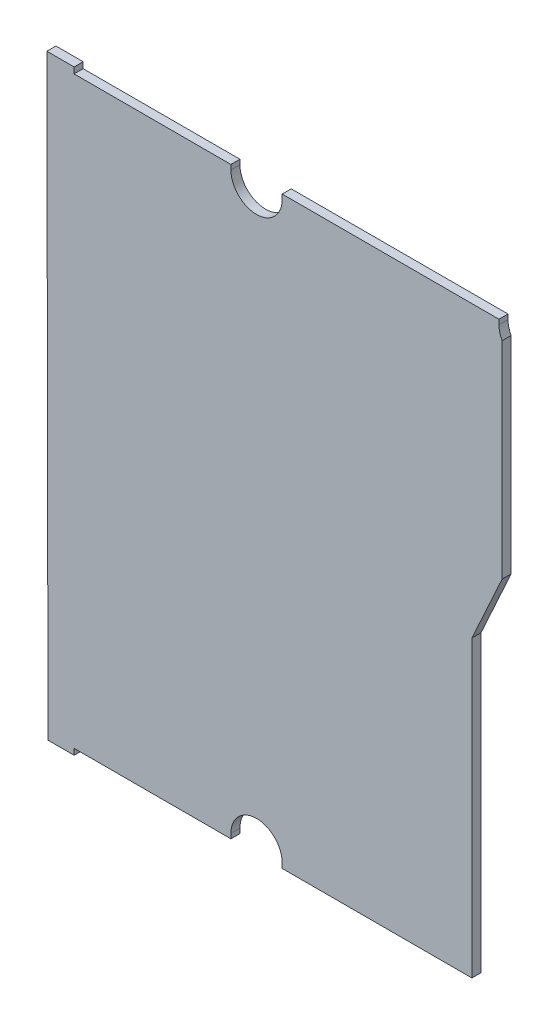
ISO-10303-21;
HEADER;
FILE_DESCRIPTION(('STEP AP214'),'2;1');
FILE_NAME('part.step','',(''),(''),'','','');
FILE_SCHEMA(('AUTOMOTIVE_DESIGN { 1 0 10303 214 1 1 1 1 }'));
ENDSEC;
DATA;
#1=APPLICATION_CONTEXT('core data for automotive mechanical design processes');
#2=APPLICATION_PROTOCOL_DEFINITION('international standard','automotive_design',2000,#1);
#3=PRODUCT_CONTEXT('',#1,'mechanical');
#4=PRODUCT('Part','Part','',(#3));
#5=PRODUCT_RELATED_PRODUCT_CATEGORY('part','',(#4));
#6=PRODUCT_DEFINITION_FORMATION('','',#4);
#7=PRODUCT_DEFINITION_CONTEXT('part definition',#1,'design');
#8=PRODUCT_DEFINITION('design','',#6,#7);
#9=PRODUCT_DEFINITION_SHAPE('','',#8);
#10=(LENGTH_UNIT() NAMED_UNIT(*) SI_UNIT(.MILLI.,.METRE.));
#11=(NAMED_UNIT(*) PLANE_ANGLE_UNIT() SI_UNIT($,.RADIAN.));
#12=(NAMED_UNIT(*) SI_UNIT($,.STERADIAN.) SOLID_ANGLE_UNIT());
#13=UNCERTAINTY_MEASURE_WITH_UNIT(LENGTH_MEASURE(1.E-05),#10,'distance_accuracy_value','');
#14=(GEOMETRIC_REPRESENTATION_CONTEXT(3) GLOBAL_UNCERTAINTY_ASSIGNED_CONTEXT((#13)) GLOBAL_UNIT_ASSIGNED_CONTEXT((#10,
#11,#12)) REPRESENTATION_CONTEXT('',''));
#15=CARTESIAN_POINT('',(0.,0.,0.));
#16=DIRECTION('',(0.,0.,1.));
#17=DIRECTION('',(1.,0.,0.));
#18=AXIS2_PLACEMENT_3D('',#15,#16,#17);
#19=CARTESIAN_POINT('',(-66.7950000000001,-49.425,1.5));
#20=DIRECTION('',(0.,1.,0.));
#21=DIRECTION('',(0.,0.,1.));
#22=AXIS2_PLACEMENT_3D('',#19,#20,#21);
#23=PLANE('',#22);
#24=DIRECTION('',(1.,0.,0.));
#25=VECTOR('',#24,1.);
#26=CARTESIAN_POINT('',(-66.7950000000001,-49.425,0.));
#27=LINE('',#26,#25);
#28=CARTESIAN_POINT('',(-66.7950000000001,-49.425,0.));
#29=VERTEX_POINT('',#28);
#30=CARTESIAN_POINT('',(-62.4676,-49.425,0.));
#31=VERTEX_POINT('',#30);
#32=EDGE_CURVE('E205',#29,#31,#27,.T.);
#33=ORIENTED_EDGE('',*,*,#32,.T.);
#34=DIRECTION('',(0.,0.,-1.));
#35=VECTOR('',#34,1.);
#36=CARTESIAN_POINT('',(-62.4676,-49.425,1.5));
#37=LINE('',#36,#35);
#38=CARTESIAN_POINT('',(-62.4676,-49.425,1.5));
#39=VERTEX_POINT('',#38);
#40=EDGE_CURVE('E11',#39,#31,#37,.T.);
#41=ORIENTED_EDGE('',*,*,#40,.F.);
#42=DIRECTION('',(1.,0.,0.));
#43=VECTOR('',#42,1.);
#44=CARTESIAN_POINT('',(-66.7950000000001,-49.425,1.5));
#45=LINE('',#44,#43);
#46=CARTESIAN_POINT('',(-66.7950000000001,-49.425,1.5));
#47=VERTEX_POINT('',#46);
#48=EDGE_CURVE('E243',#47,#39,#45,.T.);
#49=ORIENTED_EDGE('',*,*,#48,.F.);
#50=DIRECTION('',(0.,0.,-1.));
#51=VECTOR('',#50,1.);
#52=CARTESIAN_POINT('',(-66.7950000000001,-49.425,1.5));
#53=LINE('',#52,#51);
#54=EDGE_CURVE('E201',#47,#29,#53,.T.);
#55=ORIENTED_EDGE('',*,*,#54,.T.);
#56=EDGE_LOOP('',(#33,#41,#49,#55));
#57=FACE_BOUND('',#56,.T.);
#58=ADVANCED_FACE('F37',(#57),#23,.F.);
#59=CARTESIAN_POINT('',(-62.4676,-49.425,1.5));
#60=DIRECTION('',(-1.,0.,0.));
#61=DIRECTION('',(0.,0.,1.));
#62=AXIS2_PLACEMENT_3D('',#59,#60,#61);
#63=PLANE('',#62);
#64=DIRECTION('',(0.,1.,0.));
#65=VECTOR('',#64,1.);
#66=CARTESIAN_POINT('',(-62.4676,-49.425,0.));
#67=LINE('',#66,#65);
#68=CARTESIAN_POINT('',(-62.4676,-48.425,0.));
#69=VERTEX_POINT('',#68);
#70=EDGE_CURVE('E208',#31,#69,#67,.T.);
#71=ORIENTED_EDGE('',*,*,#70,.T.);
#72=DIRECTION('',(0.,0.,-1.));
#73=VECTOR('',#72,1.);
#74=CARTESIAN_POINT('',(-62.4676,-48.425,1.5));
#75=LINE('',#74,#73);
#76=CARTESIAN_POINT('',(-62.4676,-48.425,1.5));
#77=VERTEX_POINT('',#76);
#78=EDGE_CURVE('E45',#77,#69,#75,.T.);
#79=ORIENTED_EDGE('',*,*,#78,.F.);
#80=DIRECTION('',(0.,1.,0.));
#81=VECTOR('',#80,1.);
#82=CARTESIAN_POINT('',(-62.4676,-49.425,1.5));
#83=LINE('',#82,#81);
#84=EDGE_CURVE('E132',#39,#77,#83,.T.);
#85=ORIENTED_EDGE('',*,*,#84,.F.);
#86=ORIENTED_EDGE('',*,*,#40,.T.);
#87=EDGE_LOOP('',(#71,#79,#85,#86));
#88=FACE_BOUND('',#87,.T.);
#89=ADVANCED_FACE('F361',(#88),#63,.F.);
#90=CARTESIAN_POINT('',(-62.4676,-48.425,1.5));
#91=DIRECTION('',(0.,1.,0.));
#92=DIRECTION('',(0.,0.,1.));
#93=AXIS2_PLACEMENT_3D('',#90,#91,#92);
#94=PLANE('',#93);
#95=DIRECTION('',(1.,0.,0.));
#96=VECTOR('',#95,1.);
#97=CARTESIAN_POINT('',(-62.4676,-48.425,0.));
#98=LINE('',#97,#96);
#99=CARTESIAN_POINT('',(-36.4676,-48.425,0.));
#100=VERTEX_POINT('',#99);
#101=EDGE_CURVE('E210',#69,#100,#98,.T.);
#102=ORIENTED_EDGE('',*,*,#101,.T.);
#103=DIRECTION('',(0.,0.,-1.));
#104=VECTOR('',#103,1.);
#105=CARTESIAN_POINT('',(-36.4676,-48.425,1.5));
#106=LINE('',#105,#104);
#107=CARTESIAN_POINT('',(-36.4676,-48.425,1.5));
#108=VERTEX_POINT('',#107);
#109=EDGE_CURVE('E286',#108,#100,#106,.T.);
#110=ORIENTED_EDGE('',*,*,#109,.F.);
#111=DIRECTION('',(1.,0.,0.));
#112=VECTOR('',#111,1.);
#113=CARTESIAN_POINT('',(-62.4676,-48.425,1.5));
#114=LINE('',#113,#112);
#115=EDGE_CURVE('E294',#77,#108,#114,.T.);
#116=ORIENTED_EDGE('',*,*,#115,.F.);
#117=ORIENTED_EDGE('',*,*,#78,.T.);
#118=EDGE_LOOP('',(#102,#110,#116,#117));
#119=FACE_BOUND('',#118,.T.);
#120=ADVANCED_FACE('F292',(#119),#94,.F.);
#121=CARTESIAN_POINT('',(-36.4676,-48.425,1.5));
#122=DIRECTION('',(-1.,0.,0.));
#123=DIRECTION('',(0.,0.,1.));
#124=AXIS2_PLACEMENT_3D('',#121,#122,#123);
#125=PLANE('',#124);
#126=DIRECTION('',(0.,1.,0.));
#127=VECTOR('',#126,1.);
#128=CARTESIAN_POINT('',(-36.4676,-48.425,0.));
#129=LINE('',#128,#127);
#130=CARTESIAN_POINT('',(-36.4676,-47.625,0.));
#131=VERTEX_POINT('',#130);
#132=EDGE_CURVE('E212',#100,#131,#129,.T.);
#133=ORIENTED_EDGE('',*,*,#132,.T.);
#134=DIRECTION('',(0.,0.,-1.));
#135=VECTOR('',#134,1.);
#136=CARTESIAN_POINT('',(-36.4676,-47.625,1.5));
#137=LINE('',#136,#135);
#138=CARTESIAN_POINT('',(-36.4676,-47.625,1.5));
#139=VERTEX_POINT('',#138);
#140=EDGE_CURVE('E283',#139,#131,#137,.T.);
#141=ORIENTED_EDGE('',*,*,#140,.F.);
#142=DIRECTION('',(0.,1.,0.));
#143=VECTOR('',#142,1.);
#144=CARTESIAN_POINT('',(-36.4676,-48.425,1.5));
#145=LINE('',#144,#143);
#146=EDGE_CURVE('E312',#108,#139,#145,.T.);
#147=ORIENTED_EDGE('',*,*,#146,.F.);
#148=ORIENTED_EDGE('',*,*,#109,.T.);
#149=EDGE_LOOP('',(#133,#141,#147,#148));
#150=FACE_BOUND('',#149,.T.);
#151=ADVANCED_FACE('F303',(#150),#125,.F.);
#152=CARTESIAN_POINT('',(-32.215,-47.625,1.5));
#153=DIRECTION('',(0.,0.,-1.));
#154=DIRECTION('',(-1.,0.,0.));
#155=AXIS2_PLACEMENT_3D('',#152,#153,#154);
#156=CYLINDRICAL_SURFACE('',#155,4.2526);
#157=CARTESIAN_POINT('',(-32.215,-47.625,0.));
#158=DIRECTION('',(0.,0.,-1.));
#159=DIRECTION('',(-1.,0.,0.));
#160=AXIS2_PLACEMENT_3D('',#157,#158,#159);
#161=CIRCLE('',#160,4.2526);
#162=CARTESIAN_POINT('',(-27.9624,-47.625,0.));
#163=VERTEX_POINT('',#162);
#164=EDGE_CURVE('E214',#131,#163,#161,.T.);
#165=ORIENTED_EDGE('',*,*,#164,.T.);
#166=DIRECTION('',(0.,0.,-1.));
#167=VECTOR('',#166,1.);
#168=CARTESIAN_POINT('',(-27.9624,-47.625,1.5));
#169=LINE('',#168,#167);
#170=CARTESIAN_POINT('',(-27.9624,-47.625,1.5));
#171=VERTEX_POINT('',#170);
#172=EDGE_CURVE('E280',#171,#163,#169,.T.);
#173=ORIENTED_EDGE('',*,*,#172,.F.);
#174=CARTESIAN_POINT('',(-32.215,-47.625,1.5));
#175=DIRECTION('',(0.,0.,-1.));
#176=DIRECTION('',(-1.,0.,0.));
#177=AXIS2_PLACEMENT_3D('',#174,#175,#176);
#178=CIRCLE('',#177,4.2526);
#179=EDGE_CURVE('E309',#139,#171,#178,.T.);
#180=ORIENTED_EDGE('',*,*,#179,.F.);
#181=ORIENTED_EDGE('',*,*,#140,.T.);
#182=EDGE_LOOP('',(#165,#173,#180,#181));
#183=FACE_BOUND('',#182,.T.);
#184=ADVANCED_FACE('F307',(#183),#156,.F.);
#185=CARTESIAN_POINT('',(-27.9624,-48.425,1.5));
#186=DIRECTION('',(1.,0.,0.));
#187=DIRECTION('',(0.,0.,-1.));
#188=AXIS2_PLACEMENT_3D('',#185,#186,#187);
#189=PLANE('',#188);
#190=DIRECTION('',(0.,-1.,0.));
#191=VECTOR('',#190,1.);
#192=CARTESIAN_POINT('',(-27.9624,-48.425,0.));
#193=LINE('',#192,#191);
#194=CARTESIAN_POINT('',(-27.9624,-48.425,0.));
#195=VERTEX_POINT('',#194);
#196=EDGE_CURVE('E216',#163,#195,#193,.T.);
#197=ORIENTED_EDGE('',*,*,#196,.T.);
#198=DIRECTION('',(0.,0.,-1.));
#199=VECTOR('',#198,1.);
#200=CARTESIAN_POINT('',(-27.9624,-48.425,1.5));
#201=LINE('',#200,#199);
#202=CARTESIAN_POINT('',(-27.9624,-48.425,1.5));
#203=VERTEX_POINT('',#202);
#204=EDGE_CURVE('E277',#203,#195,#201,.T.);
#205=ORIENTED_EDGE('',*,*,#204,.F.);
#206=DIRECTION('',(0.,-1.,0.));
#207=VECTOR('',#206,1.);
#208=CARTESIAN_POINT('',(-27.9624,-48.425,1.5));
#209=LINE('',#208,#207);
#210=EDGE_CURVE('E311',#171,#203,#209,.T.);
#211=ORIENTED_EDGE('',*,*,#210,.F.);
#212=ORIENTED_EDGE('',*,*,#172,.T.);
#213=EDGE_LOOP('',(#197,#205,#211,#212));
#214=FACE_BOUND('',#213,.T.);
#215=ADVANCED_FACE('F374',(#214),#189,.F.);
#216=CARTESIAN_POINT('',(3.5,-48.425,1.5));
#217=DIRECTION('',(0.,1.,0.));
#218=DIRECTION('',(0.,0.,1.));
#219=AXIS2_PLACEMENT_3D('',#216,#217,#218);
#220=PLANE('',#219);
#221=DIRECTION('',(1.,0.,0.));
#222=VECTOR('',#221,1.);
#223=CARTESIAN_POINT('',(3.5,-48.425,0.));
#224=LINE('',#223,#222);
#225=CARTESIAN_POINT('',(3.5,-48.425,0.));
#226=VERTEX_POINT('',#225);
#227=EDGE_CURVE('E218',#195,#226,#224,.T.);
#228=ORIENTED_EDGE('',*,*,#227,.T.);
#229=DIRECTION('',(0.,0.,-1.));
#230=VECTOR('',#229,1.);
#231=CARTESIAN_POINT('',(3.5,-48.425,1.5));
#232=LINE('',#231,#230);
#233=CARTESIAN_POINT('',(3.5,-48.425,1.5));
#234=VERTEX_POINT('',#233);
#235=EDGE_CURVE('E274',#234,#226,#232,.T.);
#236=ORIENTED_EDGE('',*,*,#235,.F.);
#237=DIRECTION('',(1.,0.,0.));
#238=VECTOR('',#237,1.);
#239=CARTESIAN_POINT('',(3.5,-48.425,1.5));
#240=LINE('',#239,#238);
#241=EDGE_CURVE('E314',#203,#234,#240,.T.);
#242=ORIENTED_EDGE('',*,*,#241,.F.);
#243=ORIENTED_EDGE('',*,*,#204,.T.);
#244=EDGE_LOOP('',(#228,#236,#242,#243));
#245=FACE_BOUND('',#244,.T.);
#246=ADVANCED_FACE('F377',(#245),#220,.F.);
#247=CARTESIAN_POINT('',(3.5,0.401446139426954,1.5));
#248=DIRECTION('',(-1.,0.,0.));
#249=DIRECTION('',(0.,-1.,0.));
#250=AXIS2_PLACEMENT_3D('',#247,#248,#249);
#251=PLANE('',#250);
#252=DIRECTION('',(0.,1.,0.));
#253=VECTOR('',#252,1.);
#254=CARTESIAN_POINT('',(3.5,0.401446139426954,0.));
#255=LINE('',#254,#253);
#256=CARTESIAN_POINT('',(3.5,0.401446139426954,0.));
#257=VERTEX_POINT('',#256);
#258=EDGE_CURVE('E220',#226,#257,#255,.T.);
#259=ORIENTED_EDGE('',*,*,#258,.T.);
#260=DIRECTION('',(0.,0.,-1.));
#261=VECTOR('',#260,1.);
#262=CARTESIAN_POINT('',(3.5,0.401446139426954,1.5));
#263=LINE('',#262,#261);
#264=CARTESIAN_POINT('',(3.5,0.401446139426954,1.5));
#265=VERTEX_POINT('',#264);
#266=EDGE_CURVE('E271',#265,#257,#263,.T.);
#267=ORIENTED_EDGE('',*,*,#266,.F.);
#268=DIRECTION('',(0.,1.,0.));
#269=VECTOR('',#268,1.);
#270=CARTESIAN_POINT('',(3.5,0.401446139426954,1.5));
#271=LINE('',#270,#269);
#272=EDGE_CURVE('E320',#234,#265,#271,.T.);
#273=ORIENTED_EDGE('',*,*,#272,.F.);
#274=ORIENTED_EDGE('',*,*,#235,.T.);
#275=EDGE_LOOP('',(#259,#267,#273,#274));
#276=FACE_BOUND('',#275,.T.);
#277=ADVANCED_FACE('F381',(#276),#251,.F.);
#278=CARTESIAN_POINT('',(8.5,11.3447159940696,1.5));
#279=DIRECTION('',(-0.909557353352552,0.415578417344189,0.));
#280=DIRECTION('',(-0.415578417344189,-0.909557353352552,0.));
#281=AXIS2_PLACEMENT_3D('',#278,#279,#280);
#282=PLANE('',#281);
#283=DIRECTION('',(0.415578417344189,0.909557353352552,0.));
#284=VECTOR('',#283,1.);
#285=CARTESIAN_POINT('',(8.5,11.3447159940696,0.));
#286=LINE('',#285,#284);
#287=CARTESIAN_POINT('',(8.5,11.3447159940696,0.));
#288=VERTEX_POINT('',#287);
#289=EDGE_CURVE('E222',#257,#288,#286,.T.);
#290=ORIENTED_EDGE('',*,*,#289,.T.);
#291=DIRECTION('',(0.,0.,-1.));
#292=VECTOR('',#291,1.);
#293=CARTESIAN_POINT('',(8.5,11.3447159940696,1.5));
#294=LINE('',#293,#292);
#295=CARTESIAN_POINT('',(8.5,11.3447159940696,1.5));
#296=VERTEX_POINT('',#295);
#297=EDGE_CURVE('E268',#296,#288,#294,.T.);
#298=ORIENTED_EDGE('',*,*,#297,.F.);
#299=DIRECTION('',(0.415578417344189,0.909557353352552,0.));
#300=VECTOR('',#299,1.);
#301=CARTESIAN_POINT('',(8.5,11.3447159940696,1.5));
#302=LINE('',#301,#300);
#303=EDGE_CURVE('E322',#265,#296,#302,.T.);
#304=ORIENTED_EDGE('',*,*,#303,.F.);
#305=ORIENTED_EDGE('',*,*,#266,.T.);
#306=EDGE_LOOP('',(#290,#298,#304,#305));
#307=FACE_BOUND('',#306,.T.);
#308=ADVANCED_FACE('F385',(#307),#282,.F.);
#309=CARTESIAN_POINT('',(8.49999999999999,45.5916820809327,1.5));
#310=DIRECTION('',(-1.,0.,0.));
#311=DIRECTION('',(0.,-1.,0.));
#312=AXIS2_PLACEMENT_3D('',#309,#310,#311);
#313=PLANE('',#312);
#314=DIRECTION('',(0.,1.,0.));
#315=VECTOR('',#314,1.);
#316=CARTESIAN_POINT('',(8.49999999999999,45.5916820809327,0.));
#317=LINE('',#316,#315);
#318=CARTESIAN_POINT('',(8.5,45.5916820809327,0.));
#319=VERTEX_POINT('',#318);
#320=EDGE_CURVE('E224',#288,#319,#317,.T.);
#321=ORIENTED_EDGE('',*,*,#320,.T.);
#322=DIRECTION('',(0.,0.,-1.));
#323=VECTOR('',#322,1.);
#324=CARTESIAN_POINT('',(8.5,45.5916820809327,1.5));
#325=LINE('',#324,#323);
#326=CARTESIAN_POINT('',(8.5,45.5916820809327,1.5));
#327=VERTEX_POINT('',#326);
#328=EDGE_CURVE('E265',#327,#319,#325,.T.);
#329=ORIENTED_EDGE('',*,*,#328,.F.);
#330=DIRECTION('',(0.,1.,0.));
#331=VECTOR('',#330,1.);
#332=CARTESIAN_POINT('',(8.49999999999999,45.5916820809327,1.5));
#333=LINE('',#332,#331);
#334=EDGE_CURVE('E324',#296,#327,#333,.T.);
#335=ORIENTED_EDGE('',*,*,#334,.F.);
#336=ORIENTED_EDGE('',*,*,#297,.T.);
#337=EDGE_LOOP('',(#321,#329,#335,#336));
#338=FACE_BOUND('',#337,.T.);
#339=ADVANCED_FACE('F389',(#338),#313,.F.);
#340=CARTESIAN_POINT('',(12.235,47.625,1.5));
#341=DIRECTION('',(0.,0.,-1.));
#342=DIRECTION('',(-1.,0.,0.));
#343=AXIS2_PLACEMENT_3D('',#340,#341,#342);
#344=CYLINDRICAL_SURFACE('',#343,4.2526);
#345=CARTESIAN_POINT('',(12.235,47.625,0.));
#346=DIRECTION('',(0.,0.,-1.));
#347=DIRECTION('',(1.,0.,0.));
#348=AXIS2_PLACEMENT_3D('',#345,#346,#347);
#349=CIRCLE('',#348,4.2526);
#350=CARTESIAN_POINT('',(7.98239999999999,47.625,0.));
#351=VERTEX_POINT('',#350);
#352=EDGE_CURVE('E226',#319,#351,#349,.T.);
#353=ORIENTED_EDGE('',*,*,#352,.T.);
#354=DIRECTION('',(0.,0.,-1.));
#355=VECTOR('',#354,1.);
#356=CARTESIAN_POINT('',(7.98239999999999,47.625,1.5));
#357=LINE('',#356,#355);
#358=CARTESIAN_POINT('',(7.98239999999999,47.625,1.5));
#359=VERTEX_POINT('',#358);
#360=EDGE_CURVE('E262',#359,#351,#357,.T.);
#361=ORIENTED_EDGE('',*,*,#360,.F.);
#362=CARTESIAN_POINT('',(12.235,47.625,1.5));
#363=DIRECTION('',(0.,0.,-1.));
#364=DIRECTION('',(1.,0.,0.));
#365=AXIS2_PLACEMENT_3D('',#362,#363,#364);
#366=CIRCLE('',#365,4.2526);
#367=EDGE_CURVE('E326',#327,#359,#366,.T.);
#368=ORIENTED_EDGE('',*,*,#367,.F.);
#369=ORIENTED_EDGE('',*,*,#328,.T.);
#370=EDGE_LOOP('',(#353,#361,#368,#369));
#371=FACE_BOUND('',#370,.T.);
#372=ADVANCED_FACE('F393',(#371),#344,.F.);
#373=CARTESIAN_POINT('',(7.98239999999999,48.425,1.5));
#374=DIRECTION('',(-1.,0.,0.));
#375=DIRECTION('',(0.,-1.,0.));
#376=AXIS2_PLACEMENT_3D('',#373,#374,#375);
#377=PLANE('',#376);
#378=DIRECTION('',(0.,1.,0.));
#379=VECTOR('',#378,1.);
#380=CARTESIAN_POINT('',(7.98239999999999,48.425,0.));
#381=LINE('',#380,#379);
#382=CARTESIAN_POINT('',(7.98239999999999,48.425,0.));
#383=VERTEX_POINT('',#382);
#384=EDGE_CURVE('E228',#351,#383,#381,.T.);
#385=ORIENTED_EDGE('',*,*,#384,.T.);
#386=DIRECTION('',(0.,0.,-1.));
#387=VECTOR('',#386,1.);
#388=CARTESIAN_POINT('',(7.98239999999999,48.425,1.5));
#389=LINE('',#388,#387);
#390=CARTESIAN_POINT('',(7.98239999999999,48.425,1.5));
#391=VERTEX_POINT('',#390);
#392=EDGE_CURVE('E259',#391,#383,#389,.T.);
#393=ORIENTED_EDGE('',*,*,#392,.F.);
#394=DIRECTION('',(0.,1.,0.));
#395=VECTOR('',#394,1.);
#396=CARTESIAN_POINT('',(7.98239999999999,48.425,1.5));
#397=LINE('',#396,#395);
#398=EDGE_CURVE('E328',#359,#391,#397,.T.);
#399=ORIENTED_EDGE('',*,*,#398,.F.);
#400=ORIENTED_EDGE('',*,*,#360,.T.);
#401=EDGE_LOOP('',(#385,#393,#399,#400));
#402=FACE_BOUND('',#401,.T.);
#403=ADVANCED_FACE('F397',(#402),#377,.F.);
#404=CARTESIAN_POINT('',(7.98239999999999,48.425,1.5));
#405=DIRECTION('',(0.,-1.,0.));
#406=DIRECTION('',(0.,0.,-1.));
#407=AXIS2_PLACEMENT_3D('',#404,#405,#406);
#408=PLANE('',#407);
#409=DIRECTION('',(-1.,0.,0.));
#410=VECTOR('',#409,1.);
#411=CARTESIAN_POINT('',(7.98239999999999,48.425,0.));
#412=LINE('',#411,#410);
#413=CARTESIAN_POINT('',(-27.9624,48.425,0.));
#414=VERTEX_POINT('',#413);
#415=EDGE_CURVE('E230',#383,#414,#412,.T.);
#416=ORIENTED_EDGE('',*,*,#415,.T.);
#417=DIRECTION('',(0.,0.,-1.));
#418=VECTOR('',#417,1.);
#419=CARTESIAN_POINT('',(-27.9624,48.425,1.5));
#420=LINE('',#419,#418);
#421=CARTESIAN_POINT('',(-27.9624,48.425,1.5));
#422=VERTEX_POINT('',#421);
#423=EDGE_CURVE('E256',#422,#414,#420,.T.);
#424=ORIENTED_EDGE('',*,*,#423,.F.);
#425=DIRECTION('',(-1.,0.,0.));
#426=VECTOR('',#425,1.);
#427=CARTESIAN_POINT('',(7.98239999999999,48.425,1.5));
#428=LINE('',#427,#426);
#429=EDGE_CURVE('E330',#391,#422,#428,.T.);
#430=ORIENTED_EDGE('',*,*,#429,.F.);
#431=ORIENTED_EDGE('',*,*,#392,.T.);
#432=EDGE_LOOP('',(#416,#424,#430,#431));
#433=FACE_BOUND('',#432,.T.);
#434=ADVANCED_FACE('F401',(#433),#408,.F.);
#435=CARTESIAN_POINT('',(-27.9624,47.625,1.5));
#436=DIRECTION('',(1.,0.,0.));
#437=DIRECTION('',(0.,0.,-1.));
#438=AXIS2_PLACEMENT_3D('',#435,#436,#437);
#439=PLANE('',#438);
#440=DIRECTION('',(0.,-1.,0.));
#441=VECTOR('',#440,1.);
#442=CARTESIAN_POINT('',(-27.9624,47.625,0.));
#443=LINE('',#442,#441);
#444=CARTESIAN_POINT('',(-27.9624,47.625,0.));
#445=VERTEX_POINT('',#444);
#446=EDGE_CURVE('E232',#414,#445,#443,.T.);
#447=ORIENTED_EDGE('',*,*,#446,.T.);
#448=DIRECTION('',(0.,0.,-1.));
#449=VECTOR('',#448,1.);
#450=CARTESIAN_POINT('',(-27.9624,47.625,1.5));
#451=LINE('',#450,#449);
#452=CARTESIAN_POINT('',(-27.9624,47.625,1.5));
#453=VERTEX_POINT('',#452);
#454=EDGE_CURVE('E253',#453,#445,#451,.T.);
#455=ORIENTED_EDGE('',*,*,#454,.F.);
#456=DIRECTION('',(0.,-1.,0.));
#457=VECTOR('',#456,1.);
#458=CARTESIAN_POINT('',(-27.9624,47.625,1.5));
#459=LINE('',#458,#457);
#460=EDGE_CURVE('E332',#422,#453,#459,.T.);
#461=ORIENTED_EDGE('',*,*,#460,.F.);
#462=ORIENTED_EDGE('',*,*,#423,.T.);
#463=EDGE_LOOP('',(#447,#455,#461,#462));
#464=FACE_BOUND('',#463,.T.);
#465=ADVANCED_FACE('F405',(#464),#439,.F.);
#466=CARTESIAN_POINT('',(-32.215,47.625,1.5));
#467=DIRECTION('',(0.,0.,-1.));
#468=DIRECTION('',(-1.,0.,0.));
#469=AXIS2_PLACEMENT_3D('',#466,#467,#468);
#470=CYLINDRICAL_SURFACE('',#469,4.2526);
#471=CARTESIAN_POINT('',(-32.215,47.625,0.));
#472=DIRECTION('',(0.,0.,-1.));
#473=DIRECTION('',(1.,0.,0.));
#474=AXIS2_PLACEMENT_3D('',#471,#472,#473);
#475=CIRCLE('',#474,4.2526);
#476=CARTESIAN_POINT('',(-36.4676,47.625,0.));
#477=VERTEX_POINT('',#476);
#478=EDGE_CURVE('E234',#445,#477,#475,.T.);
#479=ORIENTED_EDGE('',*,*,#478,.T.);
#480=DIRECTION('',(0.,0.,-1.));
#481=VECTOR('',#480,1.);
#482=CARTESIAN_POINT('',(-36.4676,47.625,1.5));
#483=LINE('',#482,#481);
#484=CARTESIAN_POINT('',(-36.4676,47.625,1.5));
#485=VERTEX_POINT('',#484);
#486=EDGE_CURVE('E250',#485,#477,#483,.T.);
#487=ORIENTED_EDGE('',*,*,#486,.F.);
#488=CARTESIAN_POINT('',(-32.215,47.625,1.5));
#489=DIRECTION('',(0.,0.,-1.));
#490=DIRECTION('',(1.,0.,0.));
#491=AXIS2_PLACEMENT_3D('',#488,#489,#490);
#492=CIRCLE('',#491,4.2526);
#493=EDGE_CURVE('E334',#453,#485,#492,.T.);
#494=ORIENTED_EDGE('',*,*,#493,.F.);
#495=ORIENTED_EDGE('',*,*,#454,.T.);
#496=EDGE_LOOP('',(#479,#487,#494,#495));
#497=FACE_BOUND('',#496,.T.);
#498=ADVANCED_FACE('F409',(#497),#470,.F.);
#499=CARTESIAN_POINT('',(-36.4676,47.625,1.5));
#500=DIRECTION('',(-1.,0.,0.));
#501=DIRECTION('',(0.,0.,1.));
#502=AXIS2_PLACEMENT_3D('',#499,#500,#501);
#503=PLANE('',#502);
#504=DIRECTION('',(0.,1.,0.));
#505=VECTOR('',#504,1.);
#506=CARTESIAN_POINT('',(-36.4676,47.625,0.));
#507=LINE('',#506,#505);
#508=CARTESIAN_POINT('',(-36.4676,48.425,0.));
#509=VERTEX_POINT('',#508);
#510=EDGE_CURVE('E236',#477,#509,#507,.T.);
#511=ORIENTED_EDGE('',*,*,#510,.T.);
#512=DIRECTION('',(0.,0.,-1.));
#513=VECTOR('',#512,1.);
#514=CARTESIAN_POINT('',(-36.4676,48.425,1.5));
#515=LINE('',#514,#513);
#516=CARTESIAN_POINT('',(-36.4676,48.425,1.5));
#517=VERTEX_POINT('',#516);
#518=EDGE_CURVE('E247',#517,#509,#515,.T.);
#519=ORIENTED_EDGE('',*,*,#518,.F.);
#520=DIRECTION('',(0.,1.,0.));
#521=VECTOR('',#520,1.);
#522=CARTESIAN_POINT('',(-36.4676,47.625,1.5));
#523=LINE('',#522,#521);
#524=EDGE_CURVE('E336',#485,#517,#523,.T.);
#525=ORIENTED_EDGE('',*,*,#524,.F.);
#526=ORIENTED_EDGE('',*,*,#486,.T.);
#527=EDGE_LOOP('',(#511,#519,#525,#526));
#528=FACE_BOUND('',#527,.T.);
#529=ADVANCED_FACE('F342',(#528),#503,.F.);
#530=CARTESIAN_POINT('',(-62.4676,48.425,1.5));
#531=DIRECTION('',(0.,-1.,0.));
#532=DIRECTION('',(0.,0.,-1.));
#533=AXIS2_PLACEMENT_3D('',#530,#531,#532);
#534=PLANE('',#533);
#535=DIRECTION('',(-1.,0.,0.));
#536=VECTOR('',#535,1.);
#537=CARTESIAN_POINT('',(-62.4676,48.425,0.));
#538=LINE('',#537,#536);
#539=CARTESIAN_POINT('',(-62.4676,48.425,0.));
#540=VERTEX_POINT('',#539);
#541=EDGE_CURVE('E238',#509,#540,#538,.T.);
#542=ORIENTED_EDGE('',*,*,#541,.T.);
#543=DIRECTION('',(0.,0.,-1.));
#544=VECTOR('',#543,1.);
#545=CARTESIAN_POINT('',(-62.4676,48.425,1.5));
#546=LINE('',#545,#544);
#547=CARTESIAN_POINT('',(-62.4676,48.425,1.5));
#548=VERTEX_POINT('',#547);
#549=EDGE_CURVE('E196',#548,#540,#546,.T.);
#550=ORIENTED_EDGE('',*,*,#549,.F.);
#551=DIRECTION('',(-1.,0.,0.));
#552=VECTOR('',#551,1.);
#553=CARTESIAN_POINT('',(-62.4676,48.425,1.5));
#554=LINE('',#553,#552);
#555=EDGE_CURVE('E187',#517,#548,#554,.T.);
#556=ORIENTED_EDGE('',*,*,#555,.F.);
#557=ORIENTED_EDGE('',*,*,#518,.T.);
#558=EDGE_LOOP('',(#542,#550,#556,#557));
#559=FACE_BOUND('',#558,.T.);
#560=ADVANCED_FACE('F346',(#559),#534,.F.);
#561=CARTESIAN_POINT('',(-62.4676,49.425,1.5));
#562=DIRECTION('',(-1.,0.,0.));
#563=DIRECTION('',(0.,0.,1.));
#564=AXIS2_PLACEMENT_3D('',#561,#562,#563);
#565=PLANE('',#564);
#566=DIRECTION('',(0.,1.,0.));
#567=VECTOR('',#566,1.);
#568=CARTESIAN_POINT('',(-62.4676,49.425,0.));
#569=LINE('',#568,#567);
#570=CARTESIAN_POINT('',(-62.4676,49.425,0.));
#571=VERTEX_POINT('',#570);
#572=EDGE_CURVE('E195',#540,#571,#569,.T.);
#573=ORIENTED_EDGE('',*,*,#572,.T.);
#574=DIRECTION('',(0.,0.,-1.));
#575=VECTOR('',#574,1.);
#576=CARTESIAN_POINT('',(-62.4676,49.425,1.5));
#577=LINE('',#576,#575);
#578=CARTESIAN_POINT('',(-62.4676,49.425,1.5));
#579=VERTEX_POINT('',#578);
#580=EDGE_CURVE('E192',#579,#571,#577,.T.);
#581=ORIENTED_EDGE('',*,*,#580,.F.);
#582=DIRECTION('',(0.,1.,0.));
#583=VECTOR('',#582,1.);
#584=CARTESIAN_POINT('',(-62.4676,49.425,1.5));
#585=LINE('',#584,#583);
#586=EDGE_CURVE('E181',#548,#579,#585,.T.);
#587=ORIENTED_EDGE('',*,*,#586,.F.);
#588=ORIENTED_EDGE('',*,*,#549,.T.);
#589=EDGE_LOOP('',(#573,#581,#587,#588));
#590=FACE_BOUND('',#589,.T.);
#591=ADVANCED_FACE('F193',(#590),#565,.F.);
#592=CARTESIAN_POINT('',(-66.9813,49.425,1.5));
#593=DIRECTION('',(0.,-1.,0.));
#594=DIRECTION('',(0.,0.,-1.));
#595=AXIS2_PLACEMENT_3D('',#592,#593,#594);
#596=PLANE('',#595);
#597=DIRECTION('',(-1.,0.,0.));
#598=VECTOR('',#597,1.);
#599=CARTESIAN_POINT('',(-66.9813,49.425,0.));
#600=LINE('',#599,#598);
#601=CARTESIAN_POINT('',(-66.9813,49.425,0.));
#602=VERTEX_POINT('',#601);
#603=EDGE_CURVE('E118',#571,#602,#600,.T.);
#604=ORIENTED_EDGE('',*,*,#603,.T.);
#605=DIRECTION('',(0.,0.,-1.));
#606=VECTOR('',#605,1.);
#607=CARTESIAN_POINT('',(-66.9813,49.425,1.5));
#608=LINE('',#607,#606);
#609=CARTESIAN_POINT('',(-66.9813,49.425,1.5));
#610=VERTEX_POINT('',#609);
#611=EDGE_CURVE('E197',#610,#602,#608,.T.);
#612=ORIENTED_EDGE('',*,*,#611,.F.);
#613=DIRECTION('',(-1.,0.,0.));
#614=VECTOR('',#613,1.);
#615=CARTESIAN_POINT('',(-66.9813,49.425,1.5));
#616=LINE('',#615,#614);
#617=EDGE_CURVE('E185',#579,#610,#616,.T.);
#618=ORIENTED_EDGE('',*,*,#617,.F.);
#619=ORIENTED_EDGE('',*,*,#580,.T.);
#620=EDGE_LOOP('',(#604,#612,#618,#619));
#621=FACE_BOUND('',#620,.T.);
#622=ADVANCED_FACE('F199',(#621),#596,.F.);
#623=CARTESIAN_POINT('',(-66.7950000000001,-49.425,1.5));
#624=DIRECTION('',(0.999998224007163,0.00188467040093541,0.));
#625=DIRECTION('',(-0.00188467040093541,0.999998224007163,0.));
#626=AXIS2_PLACEMENT_3D('',#623,#624,#625);
#627=PLANE('',#626);
#628=DIRECTION('',(0.00188467040093541,-0.999998224007163,0.));
#629=VECTOR('',#628,1.);
#630=CARTESIAN_POINT('',(-66.7950000000001,-49.425,0.));
#631=LINE('',#630,#629);
#632=EDGE_CURVE('E124',#602,#29,#631,.T.);
#633=ORIENTED_EDGE('',*,*,#632,.T.);
#634=ORIENTED_EDGE('',*,*,#54,.F.);
#635=DIRECTION('',(0.00188467040093541,-0.999998224007163,0.));
#636=VECTOR('',#635,1.);
#637=CARTESIAN_POINT('',(-66.7950000000001,-49.425,1.5));
#638=LINE('',#637,#636);
#639=EDGE_CURVE('E53',#610,#47,#638,.T.);
#640=ORIENTED_EDGE('',*,*,#639,.F.);
#641=ORIENTED_EDGE('',*,*,#611,.T.);
#642=EDGE_LOOP('',(#633,#634,#640,#641));
#643=FACE_BOUND('',#642,.T.);
#644=ADVANCED_FACE('F350',(#643),#627,.F.);
#645=CARTESIAN_POINT('',(-32.215,-47.625,1.5));
#646=DIRECTION('',(0.,0.,-1.));
#647=DIRECTION('',(-1.,0.,0.));
#648=AXIS2_PLACEMENT_3D('',#645,#646,#647);
#649=PLANE('',#648);
#650=ORIENTED_EDGE('',*,*,#48,.T.);
#651=ORIENTED_EDGE('',*,*,#84,.T.);
#652=ORIENTED_EDGE('',*,*,#115,.T.);
#653=ORIENTED_EDGE('',*,*,#146,.T.);
#654=ORIENTED_EDGE('',*,*,#179,.T.);
#655=ORIENTED_EDGE('',*,*,#210,.T.);
#656=ORIENTED_EDGE('',*,*,#241,.T.);
#657=ORIENTED_EDGE('',*,*,#272,.T.);
#658=ORIENTED_EDGE('',*,*,#303,.T.);
#659=ORIENTED_EDGE('',*,*,#334,.T.);
#660=ORIENTED_EDGE('',*,*,#367,.T.);
#661=ORIENTED_EDGE('',*,*,#398,.T.);
#662=ORIENTED_EDGE('',*,*,#429,.T.);
#663=ORIENTED_EDGE('',*,*,#460,.T.);
#664=ORIENTED_EDGE('',*,*,#493,.T.);
#665=ORIENTED_EDGE('',*,*,#524,.T.);
#666=ORIENTED_EDGE('',*,*,#555,.T.);
#667=ORIENTED_EDGE('',*,*,#586,.T.);
#668=ORIENTED_EDGE('',*,*,#617,.T.);
#669=ORIENTED_EDGE('',*,*,#639,.T.);
#670=EDGE_LOOP('',(#650,#651,#652,#653,#654,#655,#656,#657,#658,#659,#660,#661,#662,#663,#664,
#665,#666,#667,#668,#669));
#671=FACE_BOUND('',#670,.T.);
#672=ADVANCED_FACE('F183',(#671),#649,.F.);
#673=CARTESIAN_POINT('',(-32.215,-47.625,0.));
#674=DIRECTION('',(0.,0.,-1.));
#675=DIRECTION('',(-1.,0.,0.));
#676=AXIS2_PLACEMENT_3D('',#673,#674,#675);
#677=PLANE('',#676);
#678=ORIENTED_EDGE('',*,*,#32,.F.);
#679=ORIENTED_EDGE('',*,*,#632,.F.);
#680=ORIENTED_EDGE('',*,*,#603,.F.);
#681=ORIENTED_EDGE('',*,*,#572,.F.);
#682=ORIENTED_EDGE('',*,*,#541,.F.);
#683=ORIENTED_EDGE('',*,*,#510,.F.);
#684=ORIENTED_EDGE('',*,*,#478,.F.);
#685=ORIENTED_EDGE('',*,*,#446,.F.);
#686=ORIENTED_EDGE('',*,*,#415,.F.);
#687=ORIENTED_EDGE('',*,*,#384,.F.);
#688=ORIENTED_EDGE('',*,*,#352,.F.);
#689=ORIENTED_EDGE('',*,*,#320,.F.);
#690=ORIENTED_EDGE('',*,*,#289,.F.);
#691=ORIENTED_EDGE('',*,*,#258,.F.);
#692=ORIENTED_EDGE('',*,*,#227,.F.);
#693=ORIENTED_EDGE('',*,*,#196,.F.);
#694=ORIENTED_EDGE('',*,*,#164,.F.);
#695=ORIENTED_EDGE('',*,*,#132,.F.);
#696=ORIENTED_EDGE('',*,*,#101,.F.);
#697=ORIENTED_EDGE('',*,*,#70,.F.);
#698=EDGE_LOOP('',(#678,#679,#680,#681,#682,#683,#684,#685,#686,#687,#688,#689,#690,#691,#692,
#693,#694,#695,#696,#697));
#699=FACE_BOUND('',#698,.T.);
#700=ADVANCED_FACE('F298',(#699),#677,.T.);
#701=CLOSED_SHELL('',(#58,#89,#120,#151,#184,#215,#246,#277,#308,#339,#372,#403,#434,#465,#498,
#529,#560,#591,#622,#644,#672,#700));
#702=MANIFOLD_SOLID_BREP('B2',#701);
#703=ADVANCED_BREP_SHAPE_REPRESENTATION('',(#18,#702),#14);
#704=SHAPE_DEFINITION_REPRESENTATION(#9,#703);
ENDSEC;
END-ISO-10303-21;
